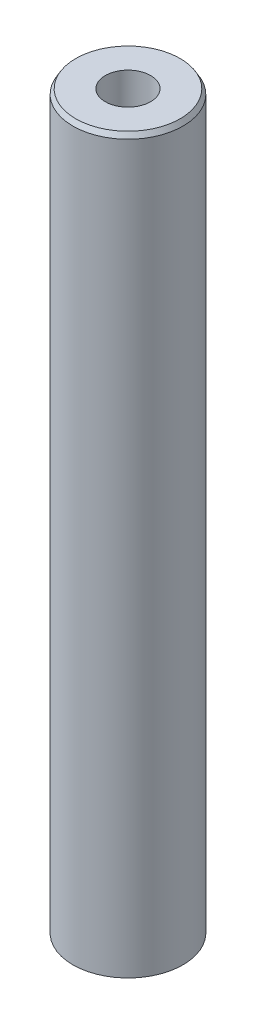
ISO-10303-21;
HEADER;
FILE_DESCRIPTION(('STEP AP214'),'2;1');
FILE_NAME('part.step','',(''),(''),'','','');
FILE_SCHEMA(('AUTOMOTIVE_DESIGN { 1 0 10303 214 1 1 1 1 }'));
ENDSEC;
DATA;
#1=APPLICATION_CONTEXT('core data for automotive mechanical design processes');
#2=APPLICATION_PROTOCOL_DEFINITION('international standard','automotive_design',2000,#1);
#3=PRODUCT_CONTEXT('',#1,'mechanical');
#4=PRODUCT('Part','Part','',(#3));
#5=PRODUCT_RELATED_PRODUCT_CATEGORY('part','',(#4));
#6=PRODUCT_DEFINITION_FORMATION('','',#4);
#7=PRODUCT_DEFINITION_CONTEXT('part definition',#1,'design');
#8=PRODUCT_DEFINITION('design','',#6,#7);
#9=PRODUCT_DEFINITION_SHAPE('','',#8);
#10=(LENGTH_UNIT() NAMED_UNIT(*) SI_UNIT(.MILLI.,.METRE.));
#11=(NAMED_UNIT(*) PLANE_ANGLE_UNIT() SI_UNIT($,.RADIAN.));
#12=(NAMED_UNIT(*) SI_UNIT($,.STERADIAN.) SOLID_ANGLE_UNIT());
#13=UNCERTAINTY_MEASURE_WITH_UNIT(LENGTH_MEASURE(1.E-05),#10,'distance_accuracy_value','');
#14=(GEOMETRIC_REPRESENTATION_CONTEXT(3) GLOBAL_UNCERTAINTY_ASSIGNED_CONTEXT((#13)) GLOBAL_UNIT_ASSIGNED_CONTEXT((#10,
#11,#12)) REPRESENTATION_CONTEXT('',''));
#15=CARTESIAN_POINT('',(0.,0.,0.));
#16=DIRECTION('',(0.,0.,1.));
#17=DIRECTION('',(1.,0.,0.));
#18=AXIS2_PLACEMENT_3D('',#15,#16,#17);
#19=CARTESIAN_POINT('',(0.,600.,0.));
#20=DIRECTION('',(0.,-1.,0.));
#21=DIRECTION('',(0.,0.,-1.));
#22=AXIS2_PLACEMENT_3D('',#19,#20,#21);
#23=CYLINDRICAL_SURFACE('',#22,45.);
#24=CARTESIAN_POINT('',(0.,595.975902481325,0.));
#25=DIRECTION('',(0.,1.,0.));
#26=DIRECTION('',(0.,0.,1.));
#27=AXIS2_PLACEMENT_3D('',#24,#25,#26);
#28=CIRCLE('',#27,45.);
#29=CARTESIAN_POINT('',(0.,595.975902481325,45.));
#30=VERTEX_POINT('',#29);
#31=EDGE_CURVE('E50',#30,#30,#28,.F.);
#32=ORIENTED_EDGE('',*,*,#31,.T.);
#33=EDGE_LOOP('',(#32));
#34=FACE_BOUND('',#33,.T.);
#35=CARTESIAN_POINT('',(0.,2.32331378565243,0.));
#36=DIRECTION('',(0.,1.,0.));
#37=DIRECTION('',(0.,0.,1.));
#38=AXIS2_PLACEMENT_3D('',#35,#36,#37);
#39=CIRCLE('',#38,45.);
#40=CARTESIAN_POINT('',(0.,2.32331378565243,45.));
#41=VERTEX_POINT('',#40);
#42=EDGE_CURVE('E51',#41,#41,#39,.T.);
#43=ORIENTED_EDGE('',*,*,#42,.T.);
#44=EDGE_LOOP('',(#43));
#45=FACE_BOUND('',#44,.T.);
#46=ADVANCED_FACE('F39',(#34,#45),#23,.T.);
#47=CARTESIAN_POINT('',(0.,600.,0.));
#48=DIRECTION('',(0.,1.,0.));
#49=DIRECTION('',(0.,0.,1.));
#50=AXIS2_PLACEMENT_3D('',#47,#48,#49);
#51=PLANE('',#50);
#52=CARTESIAN_POINT('',(0.,600.,0.));
#53=DIRECTION('',(0.,1.,0.));
#54=DIRECTION('',(0.,0.,1.));
#55=AXIS2_PLACEMENT_3D('',#52,#53,#54);
#56=CIRCLE('',#55,42.6766862143476);
#57=CARTESIAN_POINT('',(0.,600.,42.6766862143476));
#58=VERTEX_POINT('',#57);
#59=EDGE_CURVE('E54',#58,#58,#56,.T.);
#60=ORIENTED_EDGE('',*,*,#59,.T.);
#61=EDGE_LOOP('',(#60));
#62=FACE_BOUND('',#61,.T.);
#63=CARTESIAN_POINT('',(0.,600.,0.));
#64=DIRECTION('',(0.,1.,0.));
#65=DIRECTION('',(0.,0.,1.));
#66=AXIS2_PLACEMENT_3D('',#63,#64,#65);
#67=CIRCLE('',#66,18.5573242483793);
#68=CARTESIAN_POINT('',(0.,600.,18.5573242483793));
#69=VERTEX_POINT('',#68);
#70=EDGE_CURVE('E58',#69,#69,#67,.T.);
#71=ORIENTED_EDGE('',*,*,#70,.F.);
#72=EDGE_LOOP('',(#71));
#73=FACE_BOUND('',#72,.T.);
#74=ADVANCED_FACE('F69',(#62,#73),#51,.T.);
#75=CARTESIAN_POINT('',(0.,0.,0.));
#76=DIRECTION('',(0.,1.,0.));
#77=DIRECTION('',(0.,0.,1.));
#78=AXIS2_PLACEMENT_3D('',#75,#76,#77);
#79=PLANE('',#78);
#80=CARTESIAN_POINT('',(0.,0.,0.));
#81=DIRECTION('',(0.,1.,0.));
#82=DIRECTION('',(0.,0.,1.));
#83=AXIS2_PLACEMENT_3D('',#80,#81,#82);
#84=CIRCLE('',#83,40.9759024813248);
#85=CARTESIAN_POINT('',(0.,0.,40.9759024813248));
#86=VERTEX_POINT('',#85);
#87=EDGE_CURVE('E10',#86,#86,#84,.F.);
#88=ORIENTED_EDGE('',*,*,#87,.T.);
#89=EDGE_LOOP('',(#88));
#90=FACE_BOUND('',#89,.T.);
#91=CARTESIAN_POINT('',(0.,0.,0.));
#92=DIRECTION('',(0.,1.,0.));
#93=DIRECTION('',(0.,0.,1.));
#94=AXIS2_PLACEMENT_3D('',#91,#92,#93);
#95=CIRCLE('',#94,18.5573242483793);
#96=CARTESIAN_POINT('',(0.,0.,18.5573242483793));
#97=VERTEX_POINT('',#96);
#98=EDGE_CURVE('E63',#97,#97,#95,.T.);
#99=ORIENTED_EDGE('',*,*,#98,.T.);
#100=EDGE_LOOP('',(#99));
#101=FACE_BOUND('',#100,.T.);
#102=ADVANCED_FACE('F75',(#90,#101),#79,.F.);
#103=CARTESIAN_POINT('',(0.,600.,0.));
#104=DIRECTION('',(0.,-1.,0.));
#105=DIRECTION('',(0.,0.,-1.));
#106=AXIS2_PLACEMENT_3D('',#103,#104,#105);
#107=CYLINDRICAL_SURFACE('',#106,18.5573242483793);
#108=ORIENTED_EDGE('',*,*,#70,.T.);
#109=EDGE_LOOP('',(#108));
#110=FACE_BOUND('',#109,.T.);
#111=ORIENTED_EDGE('',*,*,#98,.F.);
#112=EDGE_LOOP('',(#111));
#113=FACE_BOUND('',#112,.T.);
#114=ADVANCED_FACE('F70',(#110,#113),#107,.F.);
#115=CARTESIAN_POINT('',(0.,600.,0.));
#116=DIRECTION('',(0.,-1.,0.));
#117=DIRECTION('',(0.,0.,-1.));
#118=AXIS2_PLACEMENT_3D('',#115,#116,#117);
#119=CONICAL_SURFACE('',#118,42.6766862143476,0.523598775598294);
#120=ORIENTED_EDGE('',*,*,#31,.F.);
#121=EDGE_LOOP('',(#120));
#122=FACE_BOUND('',#121,.T.);
#123=ORIENTED_EDGE('',*,*,#59,.F.);
#124=EDGE_LOOP('',(#123));
#125=FACE_BOUND('',#124,.T.);
#126=ADVANCED_FACE('F81',(#122,#125),#119,.T.);
#127=CARTESIAN_POINT('',(0.,2.32331378565243,0.));
#128=DIRECTION('',(0.,1.,0.));
#129=DIRECTION('',(0.,0.,1.));
#130=AXIS2_PLACEMENT_3D('',#127,#128,#129);
#131=CONICAL_SURFACE('',#130,45.,1.0471975511966);
#132=ORIENTED_EDGE('',*,*,#87,.F.);
#133=EDGE_LOOP('',(#132));
#134=FACE_BOUND('',#133,.T.);
#135=ORIENTED_EDGE('',*,*,#42,.F.);
#136=EDGE_LOOP('',(#135));
#137=FACE_BOUND('',#136,.T.);
#138=ADVANCED_FACE('F45',(#134,#137),#131,.T.);
#139=CLOSED_SHELL('',(#46,#74,#102,#114,#126,#138));
#140=MANIFOLD_SOLID_BREP('B2',#139);
#141=ADVANCED_BREP_SHAPE_REPRESENTATION('',(#18,#140),#14);
#142=SHAPE_DEFINITION_REPRESENTATION(#9,#141);
ENDSEC;
END-ISO-10303-21;
